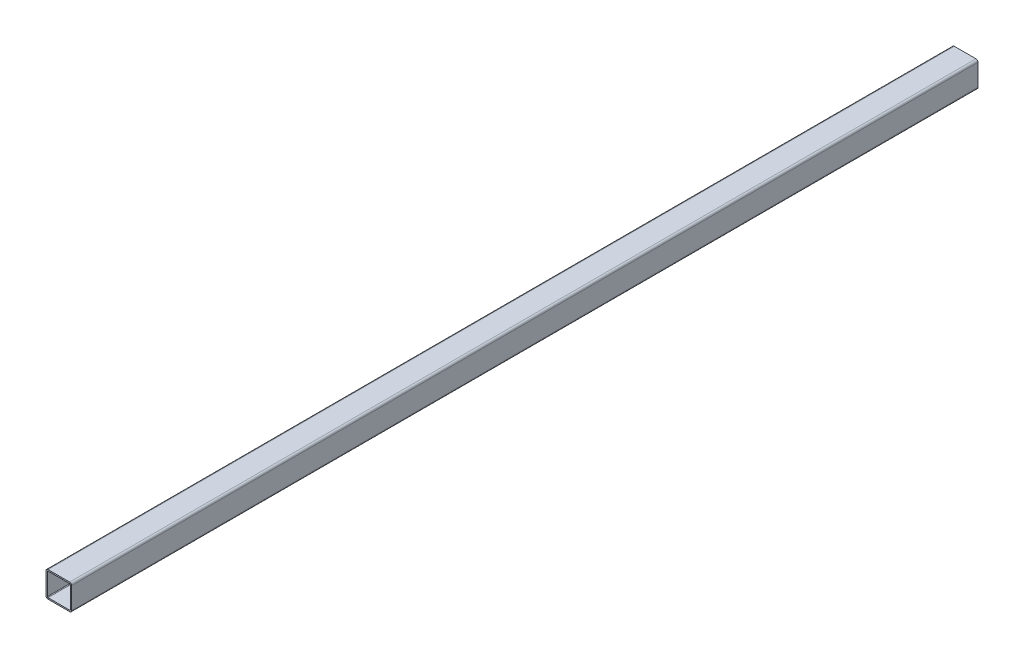
ISO-10303-21;
HEADER;
FILE_DESCRIPTION(('STEP AP214'),'2;1');
FILE_NAME('part.step','',(''),(''),'','','');
FILE_SCHEMA(('AUTOMOTIVE_DESIGN { 1 0 10303 214 1 1 1 1 }'));
ENDSEC;
DATA;
#1=APPLICATION_CONTEXT('core data for automotive mechanical design processes');
#2=APPLICATION_PROTOCOL_DEFINITION('international standard','automotive_design',2000,#1);
#3=PRODUCT_CONTEXT('',#1,'mechanical');
#4=PRODUCT('Part','Part','',(#3));
#5=PRODUCT_RELATED_PRODUCT_CATEGORY('part','',(#4));
#6=PRODUCT_DEFINITION_FORMATION('','',#4);
#7=PRODUCT_DEFINITION_CONTEXT('part definition',#1,'design');
#8=PRODUCT_DEFINITION('design','',#6,#7);
#9=PRODUCT_DEFINITION_SHAPE('','',#8);
#10=(LENGTH_UNIT() NAMED_UNIT(*) SI_UNIT(.MILLI.,.METRE.));
#11=(NAMED_UNIT(*) PLANE_ANGLE_UNIT() SI_UNIT($,.RADIAN.));
#12=(NAMED_UNIT(*) SI_UNIT($,.STERADIAN.) SOLID_ANGLE_UNIT());
#13=UNCERTAINTY_MEASURE_WITH_UNIT(LENGTH_MEASURE(1.E-05),#10,'distance_accuracy_value','');
#14=(GEOMETRIC_REPRESENTATION_CONTEXT(3) GLOBAL_UNCERTAINTY_ASSIGNED_CONTEXT((#13)) GLOBAL_UNIT_ASSIGNED_CONTEXT((#10,
#11,#12)) REPRESENTATION_CONTEXT('',''));
#15=CARTESIAN_POINT('',(0.,0.,0.));
#16=DIRECTION('',(0.,0.,1.));
#17=DIRECTION('',(1.,0.,0.));
#18=AXIS2_PLACEMENT_3D('',#15,#16,#17);
#19=CARTESIAN_POINT('',(-8.,-8.,670.));
#20=DIRECTION('',(0.,0.,-1.));
#21=DIRECTION('',(-1.,0.,0.));
#22=AXIS2_PLACEMENT_3D('',#19,#20,#21);
#23=PLANE('',#22);
#24=CARTESIAN_POINT('',(-8.,-8.,670.));
#25=DIRECTION('',(0.,0.,1.));
#26=DIRECTION('',(-1.,0.,0.));
#27=AXIS2_PLACEMENT_3D('',#24,#25,#26);
#28=CIRCLE('',#27,1.5);
#29=CARTESIAN_POINT('',(-9.5,-8.,670.));
#30=VERTEX_POINT('',#29);
#31=CARTESIAN_POINT('',(-8.,-9.5,670.));
#32=VERTEX_POINT('',#31);
#33=EDGE_CURVE('E211',#30,#32,#28,.T.);
#34=ORIENTED_EDGE('',*,*,#33,.T.);
#35=DIRECTION('',(1.,0.,0.));
#36=VECTOR('',#35,1.);
#37=CARTESIAN_POINT('',(-8.,-9.5,670.));
#38=LINE('',#37,#36);
#39=CARTESIAN_POINT('',(8.,-9.5,670.));
#40=VERTEX_POINT('',#39);
#41=EDGE_CURVE('E214',#32,#40,#38,.T.);
#42=ORIENTED_EDGE('',*,*,#41,.T.);
#43=CARTESIAN_POINT('',(8.,-8.,670.));
#44=DIRECTION('',(0.,0.,1.));
#45=DIRECTION('',(1.,0.,0.));
#46=AXIS2_PLACEMENT_3D('',#43,#44,#45);
#47=CIRCLE('',#46,1.5);
#48=CARTESIAN_POINT('',(9.5,-8.,670.));
#49=VERTEX_POINT('',#48);
#50=EDGE_CURVE('E217',#40,#49,#47,.T.);
#51=ORIENTED_EDGE('',*,*,#50,.T.);
#52=DIRECTION('',(0.,1.,0.));
#53=VECTOR('',#52,1.);
#54=CARTESIAN_POINT('',(9.5,-8.,670.));
#55=LINE('',#54,#53);
#56=CARTESIAN_POINT('',(9.5,8.,670.));
#57=VERTEX_POINT('',#56);
#58=EDGE_CURVE('E219',#49,#57,#55,.T.);
#59=ORIENTED_EDGE('',*,*,#58,.T.);
#60=CARTESIAN_POINT('',(8.,8.,670.));
#61=DIRECTION('',(0.,0.,1.));
#62=DIRECTION('',(-1.,0.,0.));
#63=AXIS2_PLACEMENT_3D('',#60,#61,#62);
#64=CIRCLE('',#63,1.5);
#65=CARTESIAN_POINT('',(8.,9.5,670.));
#66=VERTEX_POINT('',#65);
#67=EDGE_CURVE('E221',#57,#66,#64,.T.);
#68=ORIENTED_EDGE('',*,*,#67,.T.);
#69=DIRECTION('',(-1.,0.,0.));
#70=VECTOR('',#69,1.);
#71=CARTESIAN_POINT('',(-8.,9.5,670.));
#72=LINE('',#71,#70);
#73=CARTESIAN_POINT('',(-8.,9.5,670.));
#74=VERTEX_POINT('',#73);
#75=EDGE_CURVE('E223',#66,#74,#72,.T.);
#76=ORIENTED_EDGE('',*,*,#75,.T.);
#77=CARTESIAN_POINT('',(-8.,8.,670.));
#78=DIRECTION('',(0.,0.,1.));
#79=DIRECTION('',(-1.,0.,0.));
#80=AXIS2_PLACEMENT_3D('',#77,#78,#79);
#81=CIRCLE('',#80,1.5);
#82=CARTESIAN_POINT('',(-9.5,8.,670.));
#83=VERTEX_POINT('',#82);
#84=EDGE_CURVE('E225',#74,#83,#81,.T.);
#85=ORIENTED_EDGE('',*,*,#84,.T.);
#86=DIRECTION('',(0.,-1.,0.));
#87=VECTOR('',#86,1.);
#88=CARTESIAN_POINT('',(-9.5,-8.,670.));
#89=LINE('',#88,#87);
#90=EDGE_CURVE('E227',#83,#30,#89,.T.);
#91=ORIENTED_EDGE('',*,*,#90,.T.);
#92=EDGE_LOOP('',(#34,#42,#51,#59,#68,#76,#85,#91));
#93=FACE_BOUND('',#92,.T.);
#94=CARTESIAN_POINT('',(-8.,8.,670.));
#95=DIRECTION('',(0.,0.,1.));
#96=DIRECTION('',(-1.,0.,0.));
#97=AXIS2_PLACEMENT_3D('',#94,#95,#96);
#98=CIRCLE('',#97,0.5);
#99=CARTESIAN_POINT('',(-8.,8.5,670.));
#100=VERTEX_POINT('',#99);
#101=CARTESIAN_POINT('',(-8.5,8.,670.));
#102=VERTEX_POINT('',#101);
#103=EDGE_CURVE('E146',#100,#102,#98,.T.);
#104=ORIENTED_EDGE('',*,*,#103,.F.);
#105=DIRECTION('',(-1.,0.,0.));
#106=VECTOR('',#105,1.);
#107=CARTESIAN_POINT('',(-8.,8.5,670.));
#108=LINE('',#107,#106);
#109=CARTESIAN_POINT('',(8.,8.5,670.));
#110=VERTEX_POINT('',#109);
#111=EDGE_CURVE('E179',#110,#100,#108,.T.);
#112=ORIENTED_EDGE('',*,*,#111,.F.);
#113=CARTESIAN_POINT('',(8.,8.,670.));
#114=DIRECTION('',(0.,0.,1.));
#115=DIRECTION('',(-1.,0.,0.));
#116=AXIS2_PLACEMENT_3D('',#113,#114,#115);
#117=CIRCLE('',#116,0.5);
#118=CARTESIAN_POINT('',(8.5,8.,670.));
#119=VERTEX_POINT('',#118);
#120=EDGE_CURVE('E177',#119,#110,#117,.T.);
#121=ORIENTED_EDGE('',*,*,#120,.F.);
#122=DIRECTION('',(0.,1.,0.));
#123=VECTOR('',#122,1.);
#124=CARTESIAN_POINT('',(8.5,-8.,670.));
#125=LINE('',#124,#123);
#126=CARTESIAN_POINT('',(8.5,-8.,670.));
#127=VERTEX_POINT('',#126);
#128=EDGE_CURVE('E175',#127,#119,#125,.T.);
#129=ORIENTED_EDGE('',*,*,#128,.F.);
#130=CARTESIAN_POINT('',(8.,-8.,670.));
#131=DIRECTION('',(0.,0.,1.));
#132=DIRECTION('',(1.,0.,0.));
#133=AXIS2_PLACEMENT_3D('',#130,#131,#132);
#134=CIRCLE('',#133,0.5);
#135=CARTESIAN_POINT('',(8.,-8.5,670.));
#136=VERTEX_POINT('',#135);
#137=EDGE_CURVE('E173',#136,#127,#134,.T.);
#138=ORIENTED_EDGE('',*,*,#137,.F.);
#139=DIRECTION('',(1.,0.,0.));
#140=VECTOR('',#139,1.);
#141=CARTESIAN_POINT('',(-8.,-8.5,670.));
#142=LINE('',#141,#140);
#143=CARTESIAN_POINT('',(-8.,-8.5,670.));
#144=VERTEX_POINT('',#143);
#145=EDGE_CURVE('E169',#144,#136,#142,.T.);
#146=ORIENTED_EDGE('',*,*,#145,.F.);
#147=CARTESIAN_POINT('',(-8.,-8.,670.));
#148=DIRECTION('',(0.,0.,1.));
#149=DIRECTION('',(-1.,0.,0.));
#150=AXIS2_PLACEMENT_3D('',#147,#148,#149);
#151=CIRCLE('',#150,0.5);
#152=CARTESIAN_POINT('',(-8.5,-8.,670.));
#153=VERTEX_POINT('',#152);
#154=EDGE_CURVE('E167',#153,#144,#151,.T.);
#155=ORIENTED_EDGE('',*,*,#154,.F.);
#156=DIRECTION('',(0.,-1.,0.));
#157=VECTOR('',#156,1.);
#158=CARTESIAN_POINT('',(-8.5,-8.,670.));
#159=LINE('',#158,#157);
#160=EDGE_CURVE('E154',#102,#153,#159,.T.);
#161=ORIENTED_EDGE('',*,*,#160,.F.);
#162=EDGE_LOOP('',(#104,#112,#121,#129,#138,#146,#155,#161));
#163=FACE_BOUND('',#162,.T.);
#164=ADVANCED_FACE('F33',(#93,#163),#23,.F.);
#165=CARTESIAN_POINT('',(-8.,-8.,0.));
#166=DIRECTION('',(0.,0.,-1.));
#167=DIRECTION('',(-1.,0.,0.));
#168=AXIS2_PLACEMENT_3D('',#165,#166,#167);
#169=PLANE('',#168);
#170=CARTESIAN_POINT('',(-8.,-8.,0.));
#171=DIRECTION('',(0.,0.,1.));
#172=DIRECTION('',(-1.,0.,0.));
#173=AXIS2_PLACEMENT_3D('',#170,#171,#172);
#174=CIRCLE('',#173,1.5);
#175=CARTESIAN_POINT('',(-9.5,-8.,0.));
#176=VERTEX_POINT('',#175);
#177=CARTESIAN_POINT('',(-8.,-9.5,0.));
#178=VERTEX_POINT('',#177);
#179=EDGE_CURVE('E162',#176,#178,#174,.T.);
#180=ORIENTED_EDGE('',*,*,#179,.F.);
#181=DIRECTION('',(0.,-1.,0.));
#182=VECTOR('',#181,1.);
#183=CARTESIAN_POINT('',(-9.5,-8.,0.));
#184=LINE('',#183,#182);
#185=CARTESIAN_POINT('',(-9.5,8.,0.));
#186=VERTEX_POINT('',#185);
#187=EDGE_CURVE('E215',#186,#176,#184,.T.);
#188=ORIENTED_EDGE('',*,*,#187,.F.);
#189=CARTESIAN_POINT('',(-8.,8.,0.));
#190=DIRECTION('',(0.,0.,1.));
#191=DIRECTION('',(-1.,0.,0.));
#192=AXIS2_PLACEMENT_3D('',#189,#190,#191);
#193=CIRCLE('',#192,1.5);
#194=CARTESIAN_POINT('',(-8.,9.5,0.));
#195=VERTEX_POINT('',#194);
#196=EDGE_CURVE('E242',#195,#186,#193,.T.);
#197=ORIENTED_EDGE('',*,*,#196,.F.);
#198=DIRECTION('',(-1.,0.,0.));
#199=VECTOR('',#198,1.);
#200=CARTESIAN_POINT('',(-8.,9.5,0.));
#201=LINE('',#200,#199);
#202=CARTESIAN_POINT('',(8.,9.5,0.));
#203=VERTEX_POINT('',#202);
#204=EDGE_CURVE('E240',#203,#195,#201,.T.);
#205=ORIENTED_EDGE('',*,*,#204,.F.);
#206=CARTESIAN_POINT('',(8.,8.,0.));
#207=DIRECTION('',(0.,0.,1.));
#208=DIRECTION('',(-1.,0.,0.));
#209=AXIS2_PLACEMENT_3D('',#206,#207,#208);
#210=CIRCLE('',#209,1.5);
#211=CARTESIAN_POINT('',(9.5,8.,0.));
#212=VERTEX_POINT('',#211);
#213=EDGE_CURVE('E238',#212,#203,#210,.T.);
#214=ORIENTED_EDGE('',*,*,#213,.F.);
#215=DIRECTION('',(0.,1.,0.));
#216=VECTOR('',#215,1.);
#217=CARTESIAN_POINT('',(9.5,-8.,0.));
#218=LINE('',#217,#216);
#219=CARTESIAN_POINT('',(9.5,-8.,0.));
#220=VERTEX_POINT('',#219);
#221=EDGE_CURVE('E236',#220,#212,#218,.T.);
#222=ORIENTED_EDGE('',*,*,#221,.F.);
#223=CARTESIAN_POINT('',(8.,-8.,0.));
#224=DIRECTION('',(0.,0.,1.));
#225=DIRECTION('',(1.,0.,0.));
#226=AXIS2_PLACEMENT_3D('',#223,#224,#225);
#227=CIRCLE('',#226,1.5);
#228=CARTESIAN_POINT('',(8.,-9.5,0.));
#229=VERTEX_POINT('',#228);
#230=EDGE_CURVE('E234',#229,#220,#227,.T.);
#231=ORIENTED_EDGE('',*,*,#230,.F.);
#232=DIRECTION('',(1.,0.,0.));
#233=VECTOR('',#232,1.);
#234=CARTESIAN_POINT('',(-8.,-9.5,0.));
#235=LINE('',#234,#233);
#236=EDGE_CURVE('E232',#178,#229,#235,.T.);
#237=ORIENTED_EDGE('',*,*,#236,.F.);
#238=EDGE_LOOP('',(#180,#188,#197,#205,#214,#222,#231,#237));
#239=FACE_BOUND('',#238,.T.);
#240=DIRECTION('',(-1.,0.,0.));
#241=VECTOR('',#240,1.);
#242=CARTESIAN_POINT('',(-8.,8.5,0.));
#243=LINE('',#242,#241);
#244=CARTESIAN_POINT('',(8.,8.5,0.));
#245=VERTEX_POINT('',#244);
#246=CARTESIAN_POINT('',(-8.,8.5,0.));
#247=VERTEX_POINT('',#246);
#248=EDGE_CURVE('E155',#245,#247,#243,.T.);
#249=ORIENTED_EDGE('',*,*,#248,.T.);
#250=CARTESIAN_POINT('',(-8.,8.,0.));
#251=DIRECTION('',(0.,0.,1.));
#252=DIRECTION('',(-1.,0.,0.));
#253=AXIS2_PLACEMENT_3D('',#250,#251,#252);
#254=CIRCLE('',#253,0.5);
#255=CARTESIAN_POINT('',(-8.5,8.,0.));
#256=VERTEX_POINT('',#255);
#257=EDGE_CURVE('E56',#247,#256,#254,.T.);
#258=ORIENTED_EDGE('',*,*,#257,.T.);
#259=DIRECTION('',(0.,-1.,0.));
#260=VECTOR('',#259,1.);
#261=CARTESIAN_POINT('',(-8.5,-8.,0.));
#262=LINE('',#261,#260);
#263=CARTESIAN_POINT('',(-8.5,-8.,0.));
#264=VERTEX_POINT('',#263);
#265=EDGE_CURVE('E161',#256,#264,#262,.T.);
#266=ORIENTED_EDGE('',*,*,#265,.T.);
#267=CARTESIAN_POINT('',(-8.,-8.,0.));
#268=DIRECTION('',(0.,0.,1.));
#269=DIRECTION('',(-1.,0.,0.));
#270=AXIS2_PLACEMENT_3D('',#267,#268,#269);
#271=CIRCLE('',#270,0.5);
#272=CARTESIAN_POINT('',(-8.,-8.5,0.));
#273=VERTEX_POINT('',#272);
#274=EDGE_CURVE('E183',#264,#273,#271,.T.);
#275=ORIENTED_EDGE('',*,*,#274,.T.);
#276=DIRECTION('',(1.,0.,0.));
#277=VECTOR('',#276,1.);
#278=CARTESIAN_POINT('',(-8.,-8.5,0.));
#279=LINE('',#278,#277);
#280=CARTESIAN_POINT('',(8.,-8.5,0.));
#281=VERTEX_POINT('',#280);
#282=EDGE_CURVE('E186',#273,#281,#279,.T.);
#283=ORIENTED_EDGE('',*,*,#282,.T.);
#284=CARTESIAN_POINT('',(8.,-8.,0.));
#285=DIRECTION('',(0.,0.,1.));
#286=DIRECTION('',(1.,0.,0.));
#287=AXIS2_PLACEMENT_3D('',#284,#285,#286);
#288=CIRCLE('',#287,0.5);
#289=CARTESIAN_POINT('',(8.5,-8.,0.));
#290=VERTEX_POINT('',#289);
#291=EDGE_CURVE('E189',#281,#290,#288,.T.);
#292=ORIENTED_EDGE('',*,*,#291,.T.);
#293=DIRECTION('',(0.,1.,0.));
#294=VECTOR('',#293,1.);
#295=CARTESIAN_POINT('',(8.5,-8.,0.));
#296=LINE('',#295,#294);
#297=CARTESIAN_POINT('',(8.5,8.,0.));
#298=VERTEX_POINT('',#297);
#299=EDGE_CURVE('E192',#290,#298,#296,.T.);
#300=ORIENTED_EDGE('',*,*,#299,.T.);
#301=CARTESIAN_POINT('',(8.,8.,0.));
#302=DIRECTION('',(0.,0.,1.));
#303=DIRECTION('',(-1.,0.,0.));
#304=AXIS2_PLACEMENT_3D('',#301,#302,#303);
#305=CIRCLE('',#304,0.5);
#306=EDGE_CURVE('E195',#298,#245,#305,.T.);
#307=ORIENTED_EDGE('',*,*,#306,.T.);
#308=EDGE_LOOP('',(#249,#258,#266,#275,#283,#292,#300,#307));
#309=FACE_BOUND('',#308,.T.);
#310=ADVANCED_FACE('F272',(#239,#309),#169,.T.);
#311=CARTESIAN_POINT('',(-8.,-8.,670.));
#312=DIRECTION('',(0.,0.,-1.));
#313=DIRECTION('',(-1.,0.,0.));
#314=AXIS2_PLACEMENT_3D('',#311,#312,#313);
#315=CYLINDRICAL_SURFACE('',#314,1.5);
#316=ORIENTED_EDGE('',*,*,#179,.T.);
#317=DIRECTION('',(0.,0.,-1.));
#318=VECTOR('',#317,1.);
#319=CARTESIAN_POINT('',(-8.,-9.5,670.));
#320=LINE('',#319,#318);
#321=EDGE_CURVE('E11',#32,#178,#320,.T.);
#322=ORIENTED_EDGE('',*,*,#321,.F.);
#323=ORIENTED_EDGE('',*,*,#33,.F.);
#324=DIRECTION('',(0.,0.,-1.));
#325=VECTOR('',#324,1.);
#326=CARTESIAN_POINT('',(-9.5,-8.,670.));
#327=LINE('',#326,#325);
#328=EDGE_CURVE('E229',#30,#176,#327,.T.);
#329=ORIENTED_EDGE('',*,*,#328,.T.);
#330=EDGE_LOOP('',(#316,#322,#323,#329));
#331=FACE_BOUND('',#330,.T.);
#332=ADVANCED_FACE('F35',(#331),#315,.T.);
#333=CARTESIAN_POINT('',(-8.,-9.5,670.));
#334=DIRECTION('',(0.,1.,0.));
#335=DIRECTION('',(-1.,0.,0.));
#336=AXIS2_PLACEMENT_3D('',#333,#334,#335);
#337=PLANE('',#336);
#338=ORIENTED_EDGE('',*,*,#236,.T.);
#339=DIRECTION('',(0.,0.,-1.));
#340=VECTOR('',#339,1.);
#341=CARTESIAN_POINT('',(8.,-9.5,670.));
#342=LINE('',#341,#340);
#343=EDGE_CURVE('E41',#40,#229,#342,.T.);
#344=ORIENTED_EDGE('',*,*,#343,.F.);
#345=ORIENTED_EDGE('',*,*,#41,.F.);
#346=ORIENTED_EDGE('',*,*,#321,.T.);
#347=EDGE_LOOP('',(#338,#344,#345,#346));
#348=FACE_BOUND('',#347,.T.);
#349=ADVANCED_FACE('F289',(#348),#337,.F.);
#350=CARTESIAN_POINT('',(8.,-8.,670.));
#351=DIRECTION('',(0.,0.,-1.));
#352=DIRECTION('',(-1.,0.,0.));
#353=AXIS2_PLACEMENT_3D('',#350,#351,#352);
#354=CYLINDRICAL_SURFACE('',#353,1.5);
#355=ORIENTED_EDGE('',*,*,#230,.T.);
#356=DIRECTION('',(0.,0.,-1.));
#357=VECTOR('',#356,1.);
#358=CARTESIAN_POINT('',(9.5,-8.,670.));
#359=LINE('',#358,#357);
#360=EDGE_CURVE('E259',#49,#220,#359,.T.);
#361=ORIENTED_EDGE('',*,*,#360,.F.);
#362=ORIENTED_EDGE('',*,*,#50,.F.);
#363=ORIENTED_EDGE('',*,*,#343,.T.);
#364=EDGE_LOOP('',(#355,#361,#362,#363));
#365=FACE_BOUND('',#364,.T.);
#366=ADVANCED_FACE('F266',(#365),#354,.T.);
#367=CARTESIAN_POINT('',(9.5,-8.,670.));
#368=DIRECTION('',(-1.,0.,0.));
#369=DIRECTION('',(0.,0.,1.));
#370=AXIS2_PLACEMENT_3D('',#367,#368,#369);
#371=PLANE('',#370);
#372=ORIENTED_EDGE('',*,*,#221,.T.);
#373=DIRECTION('',(0.,0.,-1.));
#374=VECTOR('',#373,1.);
#375=CARTESIAN_POINT('',(9.5,8.,670.));
#376=LINE('',#375,#374);
#377=EDGE_CURVE('E256',#57,#212,#376,.T.);
#378=ORIENTED_EDGE('',*,*,#377,.F.);
#379=ORIENTED_EDGE('',*,*,#58,.F.);
#380=ORIENTED_EDGE('',*,*,#360,.T.);
#381=EDGE_LOOP('',(#372,#378,#379,#380));
#382=FACE_BOUND('',#381,.T.);
#383=ADVANCED_FACE('F278',(#382),#371,.F.);
#384=CARTESIAN_POINT('',(8.,8.,670.));
#385=DIRECTION('',(0.,0.,-1.));
#386=DIRECTION('',(-1.,0.,0.));
#387=AXIS2_PLACEMENT_3D('',#384,#385,#386);
#388=CYLINDRICAL_SURFACE('',#387,1.5);
#389=ORIENTED_EDGE('',*,*,#213,.T.);
#390=DIRECTION('',(0.,0.,-1.));
#391=VECTOR('',#390,1.);
#392=CARTESIAN_POINT('',(8.,9.5,670.));
#393=LINE('',#392,#391);
#394=EDGE_CURVE('E253',#66,#203,#393,.T.);
#395=ORIENTED_EDGE('',*,*,#394,.F.);
#396=ORIENTED_EDGE('',*,*,#67,.F.);
#397=ORIENTED_EDGE('',*,*,#377,.T.);
#398=EDGE_LOOP('',(#389,#395,#396,#397));
#399=FACE_BOUND('',#398,.T.);
#400=ADVANCED_FACE('F282',(#399),#388,.T.);
#401=CARTESIAN_POINT('',(-8.,9.5,670.));
#402=DIRECTION('',(0.,-1.,0.));
#403=DIRECTION('',(1.,0.,0.));
#404=AXIS2_PLACEMENT_3D('',#401,#402,#403);
#405=PLANE('',#404);
#406=ORIENTED_EDGE('',*,*,#204,.T.);
#407=DIRECTION('',(0.,0.,-1.));
#408=VECTOR('',#407,1.);
#409=CARTESIAN_POINT('',(-8.,9.5,670.));
#410=LINE('',#409,#408);
#411=EDGE_CURVE('E250',#74,#195,#410,.T.);
#412=ORIENTED_EDGE('',*,*,#411,.F.);
#413=ORIENTED_EDGE('',*,*,#75,.F.);
#414=ORIENTED_EDGE('',*,*,#394,.T.);
#415=EDGE_LOOP('',(#406,#412,#413,#414));
#416=FACE_BOUND('',#415,.T.);
#417=ADVANCED_FACE('F302',(#416),#405,.F.);
#418=CARTESIAN_POINT('',(-8.,8.,670.));
#419=DIRECTION('',(0.,0.,-1.));
#420=DIRECTION('',(-1.,0.,0.));
#421=AXIS2_PLACEMENT_3D('',#418,#419,#420);
#422=CYLINDRICAL_SURFACE('',#421,1.5);
#423=ORIENTED_EDGE('',*,*,#196,.T.);
#424=DIRECTION('',(0.,0.,-1.));
#425=VECTOR('',#424,1.);
#426=CARTESIAN_POINT('',(-9.5,8.,670.));
#427=LINE('',#426,#425);
#428=EDGE_CURVE('E247',#83,#186,#427,.T.);
#429=ORIENTED_EDGE('',*,*,#428,.F.);
#430=ORIENTED_EDGE('',*,*,#84,.F.);
#431=ORIENTED_EDGE('',*,*,#411,.T.);
#432=EDGE_LOOP('',(#423,#429,#430,#431));
#433=FACE_BOUND('',#432,.T.);
#434=ADVANCED_FACE('F300',(#433),#422,.T.);
#435=CARTESIAN_POINT('',(-9.5,-8.,670.));
#436=DIRECTION('',(1.,0.,0.));
#437=DIRECTION('',(0.,1.,0.));
#438=AXIS2_PLACEMENT_3D('',#435,#436,#437);
#439=PLANE('',#438);
#440=ORIENTED_EDGE('',*,*,#187,.T.);
#441=ORIENTED_EDGE('',*,*,#328,.F.);
#442=ORIENTED_EDGE('',*,*,#90,.F.);
#443=ORIENTED_EDGE('',*,*,#428,.T.);
#444=EDGE_LOOP('',(#440,#441,#442,#443));
#445=FACE_BOUND('',#444,.T.);
#446=ADVANCED_FACE('F295',(#445),#439,.F.);
#447=CARTESIAN_POINT('',(-8.,8.,670.));
#448=DIRECTION('',(0.,0.,-1.));
#449=DIRECTION('',(-1.,0.,0.));
#450=AXIS2_PLACEMENT_3D('',#447,#448,#449);
#451=CYLINDRICAL_SURFACE('',#450,0.5);
#452=ORIENTED_EDGE('',*,*,#257,.F.);
#453=DIRECTION('',(0.,0.,-1.));
#454=VECTOR('',#453,1.);
#455=CARTESIAN_POINT('',(-8.,8.5,670.));
#456=LINE('',#455,#454);
#457=EDGE_CURVE('E150',#100,#247,#456,.T.);
#458=ORIENTED_EDGE('',*,*,#457,.F.);
#459=ORIENTED_EDGE('',*,*,#103,.T.);
#460=DIRECTION('',(0.,0.,-1.));
#461=VECTOR('',#460,1.);
#462=CARTESIAN_POINT('',(-8.5,8.,670.));
#463=LINE('',#462,#461);
#464=EDGE_CURVE('E149',#102,#256,#463,.T.);
#465=ORIENTED_EDGE('',*,*,#464,.T.);
#466=EDGE_LOOP('',(#452,#458,#459,#465));
#467=FACE_BOUND('',#466,.T.);
#468=ADVANCED_FACE('F148',(#467),#451,.F.);
#469=CARTESIAN_POINT('',(-8.5,-8.,670.));
#470=DIRECTION('',(1.,0.,0.));
#471=DIRECTION('',(0.,1.,0.));
#472=AXIS2_PLACEMENT_3D('',#469,#470,#471);
#473=PLANE('',#472);
#474=ORIENTED_EDGE('',*,*,#265,.F.);
#475=ORIENTED_EDGE('',*,*,#464,.F.);
#476=ORIENTED_EDGE('',*,*,#160,.T.);
#477=DIRECTION('',(0.,0.,-1.));
#478=VECTOR('',#477,1.);
#479=CARTESIAN_POINT('',(-8.5,-8.,670.));
#480=LINE('',#479,#478);
#481=EDGE_CURVE('E163',#153,#264,#480,.T.);
#482=ORIENTED_EDGE('',*,*,#481,.T.);
#483=EDGE_LOOP('',(#474,#475,#476,#482));
#484=FACE_BOUND('',#483,.T.);
#485=ADVANCED_FACE('F158',(#484),#473,.T.);
#486=CARTESIAN_POINT('',(-8.,-8.,670.));
#487=DIRECTION('',(0.,0.,-1.));
#488=DIRECTION('',(-1.,0.,0.));
#489=AXIS2_PLACEMENT_3D('',#486,#487,#488);
#490=CYLINDRICAL_SURFACE('',#489,0.5);
#491=ORIENTED_EDGE('',*,*,#274,.F.);
#492=ORIENTED_EDGE('',*,*,#481,.F.);
#493=ORIENTED_EDGE('',*,*,#154,.T.);
#494=DIRECTION('',(0.,0.,-1.));
#495=VECTOR('',#494,1.);
#496=CARTESIAN_POINT('',(-8.,-8.5,670.));
#497=LINE('',#496,#495);
#498=EDGE_CURVE('E208',#144,#273,#497,.T.);
#499=ORIENTED_EDGE('',*,*,#498,.T.);
#500=EDGE_LOOP('',(#491,#492,#493,#499));
#501=FACE_BOUND('',#500,.T.);
#502=ADVANCED_FACE('F327',(#501),#490,.F.);
#503=CARTESIAN_POINT('',(-8.,-8.5,670.));
#504=DIRECTION('',(0.,1.,0.));
#505=DIRECTION('',(-1.,0.,0.));
#506=AXIS2_PLACEMENT_3D('',#503,#504,#505);
#507=PLANE('',#506);
#508=ORIENTED_EDGE('',*,*,#282,.F.);
#509=ORIENTED_EDGE('',*,*,#498,.F.);
#510=ORIENTED_EDGE('',*,*,#145,.T.);
#511=DIRECTION('',(0.,0.,-1.));
#512=VECTOR('',#511,1.);
#513=CARTESIAN_POINT('',(8.,-8.5,670.));
#514=LINE('',#513,#512);
#515=EDGE_CURVE('E206',#136,#281,#514,.T.);
#516=ORIENTED_EDGE('',*,*,#515,.T.);
#517=EDGE_LOOP('',(#508,#509,#510,#516));
#518=FACE_BOUND('',#517,.T.);
#519=ADVANCED_FACE('F331',(#518),#507,.T.);
#520=CARTESIAN_POINT('',(8.,-8.,670.));
#521=DIRECTION('',(0.,0.,-1.));
#522=DIRECTION('',(-1.,0.,0.));
#523=AXIS2_PLACEMENT_3D('',#520,#521,#522);
#524=CYLINDRICAL_SURFACE('',#523,0.5);
#525=ORIENTED_EDGE('',*,*,#291,.F.);
#526=ORIENTED_EDGE('',*,*,#515,.F.);
#527=ORIENTED_EDGE('',*,*,#137,.T.);
#528=DIRECTION('',(0.,0.,-1.));
#529=VECTOR('',#528,1.);
#530=CARTESIAN_POINT('',(8.5,-8.,670.));
#531=LINE('',#530,#529);
#532=EDGE_CURVE('E204',#127,#290,#531,.T.);
#533=ORIENTED_EDGE('',*,*,#532,.T.);
#534=EDGE_LOOP('',(#525,#526,#527,#533));
#535=FACE_BOUND('',#534,.T.);
#536=ADVANCED_FACE('F337',(#535),#524,.F.);
#537=CARTESIAN_POINT('',(8.5,-8.,670.));
#538=DIRECTION('',(-1.,0.,0.));
#539=DIRECTION('',(0.,-1.,0.));
#540=AXIS2_PLACEMENT_3D('',#537,#538,#539);
#541=PLANE('',#540);
#542=ORIENTED_EDGE('',*,*,#299,.F.);
#543=ORIENTED_EDGE('',*,*,#532,.F.);
#544=ORIENTED_EDGE('',*,*,#128,.T.);
#545=DIRECTION('',(0.,0.,-1.));
#546=VECTOR('',#545,1.);
#547=CARTESIAN_POINT('',(8.5,8.,670.));
#548=LINE('',#547,#546);
#549=EDGE_CURVE('E202',#119,#298,#548,.T.);
#550=ORIENTED_EDGE('',*,*,#549,.T.);
#551=EDGE_LOOP('',(#542,#543,#544,#550));
#552=FACE_BOUND('',#551,.T.);
#553=ADVANCED_FACE('F341',(#552),#541,.T.);
#554=CARTESIAN_POINT('',(8.,8.,670.));
#555=DIRECTION('',(0.,0.,-1.));
#556=DIRECTION('',(-1.,0.,0.));
#557=AXIS2_PLACEMENT_3D('',#554,#555,#556);
#558=CYLINDRICAL_SURFACE('',#557,0.5);
#559=ORIENTED_EDGE('',*,*,#306,.F.);
#560=ORIENTED_EDGE('',*,*,#549,.F.);
#561=ORIENTED_EDGE('',*,*,#120,.T.);
#562=DIRECTION('',(0.,0.,-1.));
#563=VECTOR('',#562,1.);
#564=CARTESIAN_POINT('',(8.,8.5,670.));
#565=LINE('',#564,#563);
#566=EDGE_CURVE('E48',#110,#245,#565,.T.);
#567=ORIENTED_EDGE('',*,*,#566,.T.);
#568=EDGE_LOOP('',(#559,#560,#561,#567));
#569=FACE_BOUND('',#568,.T.);
#570=ADVANCED_FACE('F345',(#569),#558,.F.);
#571=CARTESIAN_POINT('',(-8.,8.5,670.));
#572=DIRECTION('',(0.,-1.,0.));
#573=DIRECTION('',(0.,0.,-1.));
#574=AXIS2_PLACEMENT_3D('',#571,#572,#573);
#575=PLANE('',#574);
#576=ORIENTED_EDGE('',*,*,#248,.F.);
#577=ORIENTED_EDGE('',*,*,#566,.F.);
#578=ORIENTED_EDGE('',*,*,#111,.T.);
#579=ORIENTED_EDGE('',*,*,#457,.T.);
#580=EDGE_LOOP('',(#576,#577,#578,#579));
#581=FACE_BOUND('',#580,.T.);
#582=ADVANCED_FACE('F349',(#581),#575,.T.);
#583=CLOSED_SHELL('',(#164,#310,#332,#349,#366,#383,#400,#417,#434,#446,#468,#485,#502,#519,
#536,#553,#570,#582));
#584=MANIFOLD_SOLID_BREP('B2',#583);
#585=ADVANCED_BREP_SHAPE_REPRESENTATION('',(#18,#584),#14);
#586=SHAPE_DEFINITION_REPRESENTATION(#9,#585);
ENDSEC;
END-ISO-10303-21;
